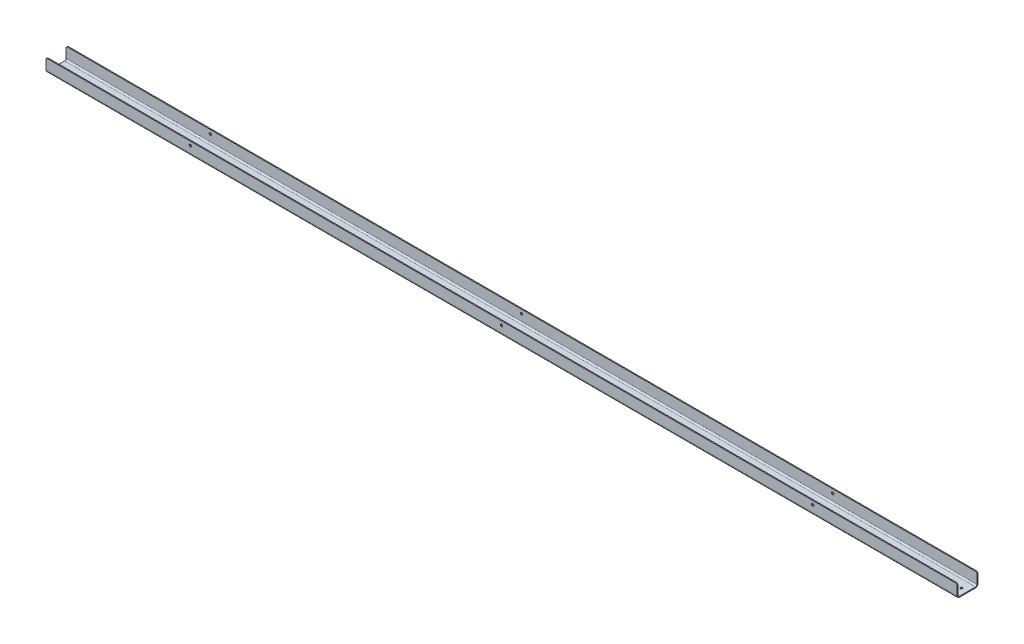
ISO-10303-21;
HEADER;
FILE_DESCRIPTION(('STEP AP214'),'2;1');
FILE_NAME('part.step','',(''),(''),'','','');
FILE_SCHEMA(('AUTOMOTIVE_DESIGN { 1 0 10303 214 1 1 1 1 }'));
ENDSEC;
DATA;
#1=APPLICATION_CONTEXT('core data for automotive mechanical design processes');
#2=APPLICATION_PROTOCOL_DEFINITION('international standard','automotive_design',2000,#1);
#3=PRODUCT_CONTEXT('',#1,'mechanical');
#4=PRODUCT('Part','Part','',(#3));
#5=PRODUCT_RELATED_PRODUCT_CATEGORY('part','',(#4));
#6=PRODUCT_DEFINITION_FORMATION('','',#4);
#7=PRODUCT_DEFINITION_CONTEXT('part definition',#1,'design');
#8=PRODUCT_DEFINITION('design','',#6,#7);
#9=PRODUCT_DEFINITION_SHAPE('','',#8);
#10=(LENGTH_UNIT() NAMED_UNIT(*) SI_UNIT(.MILLI.,.METRE.));
#11=(NAMED_UNIT(*) PLANE_ANGLE_UNIT() SI_UNIT($,.RADIAN.));
#12=(NAMED_UNIT(*) SI_UNIT($,.STERADIAN.) SOLID_ANGLE_UNIT());
#13=UNCERTAINTY_MEASURE_WITH_UNIT(LENGTH_MEASURE(1.E-05),#10,'distance_accuracy_value','');
#14=(GEOMETRIC_REPRESENTATION_CONTEXT(3) GLOBAL_UNCERTAINTY_ASSIGNED_CONTEXT((#13)) GLOBAL_UNIT_ASSIGNED_CONTEXT((#10,
#11,#12)) REPRESENTATION_CONTEXT('',''));
#15=CARTESIAN_POINT('',(0.,0.,0.));
#16=DIRECTION('',(0.,0.,1.));
#17=DIRECTION('',(1.,0.,0.));
#18=AXIS2_PLACEMENT_3D('',#15,#16,#17);
#19=CARTESIAN_POINT('',(1928.8125,5.207,0.));
#20=DIRECTION('',(1.,0.,0.));
#21=DIRECTION('',(0.,0.,-1.));
#22=AXIS2_PLACEMENT_3D('',#19,#20,#21);
#23=PLANE('',#22);
#24=DIRECTION('',(0.,0.,-1.));
#25=VECTOR('',#24,1.);
#26=CARTESIAN_POINT('',(1928.8125,5.207,0.));
#27=LINE('',#26,#25);
#28=CARTESIAN_POINT('',(1928.8125,5.207,0.));
#29=VERTEX_POINT('',#28);
#30=CARTESIAN_POINT('',(1928.8125,5.207,-2.032));
#31=VERTEX_POINT('',#30);
#32=EDGE_CURVE('E317',#29,#31,#27,.T.);
#33=ORIENTED_EDGE('',*,*,#32,.F.);
#34=CARTESIAN_POINT('',(1928.8125,5.207,-5.207));
#35=DIRECTION('',(-1.,0.,0.));
#36=DIRECTION('',(0.,0.,1.));
#37=AXIS2_PLACEMENT_3D('',#34,#35,#36);
#38=CIRCLE('',#37,5.207);
#39=CARTESIAN_POINT('',(1928.8125,0.,-5.207));
#40=VERTEX_POINT('',#39);
#41=EDGE_CURVE('E214',#29,#40,#38,.F.);
#42=ORIENTED_EDGE('',*,*,#41,.T.);
#43=DIRECTION('',(0.,-1.,0.));
#44=VECTOR('',#43,1.);
#45=CARTESIAN_POINT('',(1928.8125,2.032,-5.207));
#46=LINE('',#45,#44);
#47=CARTESIAN_POINT('',(1928.8125,2.032,-5.207));
#48=VERTEX_POINT('',#47);
#49=EDGE_CURVE('E314',#48,#40,#46,.T.);
#50=ORIENTED_EDGE('',*,*,#49,.F.);
#51=CARTESIAN_POINT('',(1928.8125,5.207,-5.207));
#52=DIRECTION('',(1.,0.,0.));
#53=DIRECTION('',(0.,0.,-1.));
#54=AXIS2_PLACEMENT_3D('',#51,#52,#53);
#55=CIRCLE('',#54,3.175);
#56=EDGE_CURVE('E201',#31,#48,#55,.T.);
#57=ORIENTED_EDGE('',*,*,#56,.F.);
#58=EDGE_LOOP('',(#33,#42,#50,#57));
#59=FACE_BOUND('',#58,.T.);
#60=ADVANCED_FACE('F45',(#59),#23,.T.);
#61=CARTESIAN_POINT('',(1928.8125,2.032,-5.207));
#62=DIRECTION('',(1.,0.,0.));
#63=DIRECTION('',(0.,0.,-1.));
#64=AXIS2_PLACEMENT_3D('',#61,#62,#63);
#65=PLANE('',#64);
#66=DIRECTION('',(0.,-1.,0.));
#67=VECTOR('',#66,1.);
#68=CARTESIAN_POINT('',(1928.8125,27.432,-2.032));
#69=LINE('',#68,#67);
#70=CARTESIAN_POINT('',(1928.8125,24.257,-2.032));
#71=VERTEX_POINT('',#70);
#72=EDGE_CURVE('E208',#71,#31,#69,.T.);
#73=ORIENTED_EDGE('',*,*,#72,.F.);
#74=DIRECTION('',(0.,0.,-1.));
#75=VECTOR('',#74,1.);
#76=CARTESIAN_POINT('',(1928.8125,24.257,-5.207));
#77=LINE('',#76,#75);
#78=CARTESIAN_POINT('',(1928.8125,24.257,0.));
#79=VERTEX_POINT('',#78);
#80=EDGE_CURVE('E334',#71,#79,#77,.F.);
#81=ORIENTED_EDGE('',*,*,#80,.T.);
#82=DIRECTION('',(0.,-1.,0.));
#83=VECTOR('',#82,1.);
#84=CARTESIAN_POINT('',(1928.8125,27.432,0.));
#85=LINE('',#84,#83);
#86=EDGE_CURVE('E211',#79,#29,#85,.T.);
#87=ORIENTED_EDGE('',*,*,#86,.T.);
#88=ORIENTED_EDGE('',*,*,#32,.T.);
#89=EDGE_LOOP('',(#73,#81,#87,#88));
#90=FACE_BOUND('',#89,.T.);
#91=ADVANCED_FACE('F405',(#90),#65,.T.);
#92=CARTESIAN_POINT('',(0.,0.,-5.207));
#93=DIRECTION('',(-1.,0.,0.));
#94=DIRECTION('',(0.,0.,1.));
#95=AXIS2_PLACEMENT_3D('',#92,#93,#94);
#96=PLANE('',#95);
#97=DIRECTION('',(0.,1.,0.));
#98=VECTOR('',#97,1.);
#99=CARTESIAN_POINT('',(0.,0.,-5.207));
#100=LINE('',#99,#98);
#101=CARTESIAN_POINT('',(0.,0.,-5.207));
#102=VERTEX_POINT('',#101);
#103=CARTESIAN_POINT('',(0.,2.032,-5.207));
#104=VERTEX_POINT('',#103);
#105=EDGE_CURVE('E311',#102,#104,#100,.T.);
#106=ORIENTED_EDGE('',*,*,#105,.F.);
#107=CARTESIAN_POINT('',(0.,5.207,-5.207));
#108=DIRECTION('',(-1.,0.,0.));
#109=DIRECTION('',(0.,0.,1.));
#110=AXIS2_PLACEMENT_3D('',#107,#108,#109);
#111=CIRCLE('',#110,5.207);
#112=CARTESIAN_POINT('',(0.,5.207,0.));
#113=VERTEX_POINT('',#112);
#114=EDGE_CURVE('E249',#113,#102,#111,.F.);
#115=ORIENTED_EDGE('',*,*,#114,.F.);
#116=DIRECTION('',(0.,0.,1.));
#117=VECTOR('',#116,1.);
#118=CARTESIAN_POINT('',(0.,5.207,-2.032));
#119=LINE('',#118,#117);
#120=CARTESIAN_POINT('',(0.,5.207,-2.032));
#121=VERTEX_POINT('',#120);
#122=EDGE_CURVE('E307',#121,#113,#119,.T.);
#123=ORIENTED_EDGE('',*,*,#122,.F.);
#124=CARTESIAN_POINT('',(0.,5.207,-5.207));
#125=DIRECTION('',(1.,0.,0.));
#126=DIRECTION('',(0.,0.,-1.));
#127=AXIS2_PLACEMENT_3D('',#124,#125,#126);
#128=CIRCLE('',#127,3.175);
#129=EDGE_CURVE('E239',#121,#104,#128,.T.);
#130=ORIENTED_EDGE('',*,*,#129,.T.);
#131=EDGE_LOOP('',(#106,#115,#123,#130));
#132=FACE_BOUND('',#131,.T.);
#133=ADVANCED_FACE('F385',(#132),#96,.T.);
#134=CARTESIAN_POINT('',(0.,5.207,-2.032));
#135=DIRECTION('',(-1.,0.,0.));
#136=DIRECTION('',(0.,0.,1.));
#137=AXIS2_PLACEMENT_3D('',#134,#135,#136);
#138=PLANE('',#137);
#139=DIRECTION('',(0.,0.,-1.));
#140=VECTOR('',#139,1.);
#141=CARTESIAN_POINT('',(0.,0.,0.));
#142=LINE('',#141,#140);
#143=CARTESIAN_POINT('',(0.,0.,-39.243));
#144=VERTEX_POINT('',#143);
#145=EDGE_CURVE('E253',#102,#144,#142,.T.);
#146=ORIENTED_EDGE('',*,*,#145,.F.);
#147=ORIENTED_EDGE('',*,*,#105,.T.);
#148=DIRECTION('',(0.,0.,-1.));
#149=VECTOR('',#148,1.);
#150=CARTESIAN_POINT('',(0.,2.032,0.));
#151=LINE('',#150,#149);
#152=CARTESIAN_POINT('',(0.,2.032,-39.243));
#153=VERTEX_POINT('',#152);
#154=EDGE_CURVE('E235',#104,#153,#151,.T.);
#155=ORIENTED_EDGE('',*,*,#154,.T.);
#156=DIRECTION('',(0.,-1.,0.));
#157=VECTOR('',#156,1.);
#158=CARTESIAN_POINT('',(0.,2.032,-39.243));
#159=LINE('',#158,#157);
#160=EDGE_CURVE('E300',#153,#144,#159,.T.);
#161=ORIENTED_EDGE('',*,*,#160,.T.);
#162=EDGE_LOOP('',(#146,#147,#155,#161));
#163=FACE_BOUND('',#162,.T.);
#164=ADVANCED_FACE('F433',(#163),#138,.T.);
#165=CARTESIAN_POINT('',(1928.8125,0.,-39.243));
#166=DIRECTION('',(1.,0.,0.));
#167=DIRECTION('',(0.,0.,-1.));
#168=AXIS2_PLACEMENT_3D('',#165,#166,#167);
#169=PLANE('',#168);
#170=DIRECTION('',(0.,1.,0.));
#171=VECTOR('',#170,1.);
#172=CARTESIAN_POINT('',(1928.8125,0.,-39.243));
#173=LINE('',#172,#171);
#174=CARTESIAN_POINT('',(1928.8125,0.,-39.243));
#175=VERTEX_POINT('',#174);
#176=CARTESIAN_POINT('',(1928.8125,2.032,-39.243));
#177=VERTEX_POINT('',#176);
#178=EDGE_CURVE('E173',#175,#177,#173,.T.);
#179=ORIENTED_EDGE('',*,*,#178,.F.);
#180=CARTESIAN_POINT('',(1928.8125,5.207,-39.243));
#181=DIRECTION('',(-1.,0.,0.));
#182=DIRECTION('',(0.,0.,1.));
#183=AXIS2_PLACEMENT_3D('',#180,#181,#182);
#184=CIRCLE('',#183,5.207);
#185=CARTESIAN_POINT('',(1928.8125,5.207,-44.45));
#186=VERTEX_POINT('',#185);
#187=EDGE_CURVE('E170',#175,#186,#184,.F.);
#188=ORIENTED_EDGE('',*,*,#187,.T.);
#189=DIRECTION('',(0.,0.,-1.));
#190=VECTOR('',#189,1.);
#191=CARTESIAN_POINT('',(1928.8125,5.207,-42.418));
#192=LINE('',#191,#190);
#193=CARTESIAN_POINT('',(1928.8125,5.207,-42.418));
#194=VERTEX_POINT('',#193);
#195=EDGE_CURVE('E163',#194,#186,#192,.T.);
#196=ORIENTED_EDGE('',*,*,#195,.F.);
#197=CARTESIAN_POINT('',(1928.8125,5.207,-39.243));
#198=DIRECTION('',(1.,0.,0.));
#199=DIRECTION('',(0.,0.,-1.));
#200=AXIS2_PLACEMENT_3D('',#197,#198,#199);
#201=CIRCLE('',#200,3.175);
#202=EDGE_CURVE('E167',#177,#194,#201,.T.);
#203=ORIENTED_EDGE('',*,*,#202,.F.);
#204=EDGE_LOOP('',(#179,#188,#196,#203));
#205=FACE_BOUND('',#204,.T.);
#206=ADVANCED_FACE('F165',(#205),#169,.T.);
#207=CARTESIAN_POINT('',(1928.8125,5.207,-42.418));
#208=DIRECTION('',(1.,0.,0.));
#209=DIRECTION('',(0.,0.,-1.));
#210=AXIS2_PLACEMENT_3D('',#207,#208,#209);
#211=PLANE('',#210);
#212=DIRECTION('',(0.,0.,-1.));
#213=VECTOR('',#212,1.);
#214=CARTESIAN_POINT('',(1928.8125,0.,0.));
#215=LINE('',#214,#213);
#216=EDGE_CURVE('E218',#40,#175,#215,.T.);
#217=ORIENTED_EDGE('',*,*,#216,.T.);
#218=ORIENTED_EDGE('',*,*,#178,.T.);
#219=DIRECTION('',(0.,0.,-1.));
#220=VECTOR('',#219,1.);
#221=CARTESIAN_POINT('',(1928.8125,2.032,0.));
#222=LINE('',#221,#220);
#223=EDGE_CURVE('E197',#48,#177,#222,.T.);
#224=ORIENTED_EDGE('',*,*,#223,.F.);
#225=ORIENTED_EDGE('',*,*,#49,.T.);
#226=EDGE_LOOP('',(#217,#218,#224,#225));
#227=FACE_BOUND('',#226,.T.);
#228=ADVANCED_FACE('F439',(#227),#211,.T.);
#229=CARTESIAN_POINT('',(0.,5.207,-44.45));
#230=DIRECTION('',(-1.,0.,0.));
#231=DIRECTION('',(0.,0.,1.));
#232=AXIS2_PLACEMENT_3D('',#229,#230,#231);
#233=PLANE('',#232);
#234=DIRECTION('',(0.,0.,1.));
#235=VECTOR('',#234,1.);
#236=CARTESIAN_POINT('',(0.,5.207,-44.45));
#237=LINE('',#236,#235);
#238=CARTESIAN_POINT('',(0.,5.207,-44.45));
#239=VERTEX_POINT('',#238);
#240=CARTESIAN_POINT('',(0.,5.207,-42.418));
#241=VERTEX_POINT('',#240);
#242=EDGE_CURVE('E174',#239,#241,#237,.T.);
#243=ORIENTED_EDGE('',*,*,#242,.F.);
#244=CARTESIAN_POINT('',(0.,5.207,-39.243));
#245=DIRECTION('',(-1.,0.,0.));
#246=DIRECTION('',(0.,0.,1.));
#247=AXIS2_PLACEMENT_3D('',#244,#245,#246);
#248=CIRCLE('',#247,5.207);
#249=EDGE_CURVE('E257',#144,#239,#248,.F.);
#250=ORIENTED_EDGE('',*,*,#249,.F.);
#251=ORIENTED_EDGE('',*,*,#160,.F.);
#252=CARTESIAN_POINT('',(0.,5.207,-39.243));
#253=DIRECTION('',(1.,0.,0.));
#254=DIRECTION('',(0.,0.,-1.));
#255=AXIS2_PLACEMENT_3D('',#252,#253,#254);
#256=CIRCLE('',#255,3.175);
#257=EDGE_CURVE('E232',#153,#241,#256,.T.);
#258=ORIENTED_EDGE('',*,*,#257,.T.);
#259=EDGE_LOOP('',(#243,#250,#251,#258));
#260=FACE_BOUND('',#259,.T.);
#261=ADVANCED_FACE('F442',(#260),#233,.T.);
#262=CARTESIAN_POINT('',(0.,2.032,-39.243));
#263=DIRECTION('',(-1.,0.,0.));
#264=DIRECTION('',(0.,0.,1.));
#265=AXIS2_PLACEMENT_3D('',#262,#263,#264);
#266=PLANE('',#265);
#267=DIRECTION('',(0.,1.,0.));
#268=VECTOR('',#267,1.);
#269=CARTESIAN_POINT('',(0.,0.,-42.418));
#270=LINE('',#269,#268);
#271=CARTESIAN_POINT('',(0.,24.257,-42.418));
#272=VERTEX_POINT('',#271);
#273=EDGE_CURVE('E181',#241,#272,#270,.T.);
#274=ORIENTED_EDGE('',*,*,#273,.T.);
#275=DIRECTION('',(0.,0.,-1.));
#276=VECTOR('',#275,1.);
#277=CARTESIAN_POINT('',(0.,24.257,-39.243));
#278=LINE('',#277,#276);
#279=CARTESIAN_POINT('',(0.,24.257,-44.45));
#280=VERTEX_POINT('',#279);
#281=EDGE_CURVE('E11',#272,#280,#278,.T.);
#282=ORIENTED_EDGE('',*,*,#281,.T.);
#283=DIRECTION('',(0.,1.,0.));
#284=VECTOR('',#283,1.);
#285=CARTESIAN_POINT('',(0.,0.,-44.45));
#286=LINE('',#285,#284);
#287=EDGE_CURVE('E225',#239,#280,#286,.T.);
#288=ORIENTED_EDGE('',*,*,#287,.F.);
#289=ORIENTED_EDGE('',*,*,#242,.T.);
#290=EDGE_LOOP('',(#274,#282,#288,#289));
#291=FACE_BOUND('',#290,.T.);
#292=ADVANCED_FACE('F446',(#291),#266,.T.);
#293=CARTESIAN_POINT('',(1928.8125,0.,-44.45));
#294=DIRECTION('',(0.,0.,1.));
#295=DIRECTION('',(1.,0.,0.));
#296=AXIS2_PLACEMENT_3D('',#293,#294,#295);
#297=PLANE('',#296);
#298=CARTESIAN_POINT('',(1623.21875,19.05,-44.45));
#299=DIRECTION('',(0.,0.,-1.));
#300=DIRECTION('',(-1.,0.,0.));
#301=AXIS2_PLACEMENT_3D('',#298,#299,#300);
#302=CIRCLE('',#301,2.45110000000003);
#303=CARTESIAN_POINT('',(1620.76765,19.05,-44.45));
#304=VERTEX_POINT('',#303);
#305=EDGE_CURVE('E546',#304,#304,#302,.T.);
#306=ORIENTED_EDGE('',*,*,#305,.F.);
#307=EDGE_LOOP('',(#306));
#308=FACE_BOUND('',#307,.T.);
#309=CARTESIAN_POINT('',(964.40625,19.05,-44.45));
#310=DIRECTION('',(0.,0.,-1.));
#311=DIRECTION('',(-1.,0.,0.));
#312=AXIS2_PLACEMENT_3D('',#309,#310,#311);
#313=CIRCLE('',#312,2.45110000000003);
#314=CARTESIAN_POINT('',(961.95515,19.05,-44.45));
#315=VERTEX_POINT('',#314);
#316=EDGE_CURVE('E561',#315,#315,#313,.T.);
#317=ORIENTED_EDGE('',*,*,#316,.F.);
#318=EDGE_LOOP('',(#317));
#319=FACE_BOUND('',#318,.T.);
#320=CARTESIAN_POINT('',(305.59375,19.05,-44.45));
#321=DIRECTION('',(0.,0.,-1.));
#322=DIRECTION('',(-1.,0.,0.));
#323=AXIS2_PLACEMENT_3D('',#320,#321,#322);
#324=CIRCLE('',#323,2.45109999999997);
#325=CARTESIAN_POINT('',(303.14265,19.05,-44.45));
#326=VERTEX_POINT('',#325);
#327=EDGE_CURVE('E569',#326,#326,#324,.T.);
#328=ORIENTED_EDGE('',*,*,#327,.F.);
#329=EDGE_LOOP('',(#328));
#330=FACE_BOUND('',#329,.T.);
#331=DIRECTION('',(-1.,0.,0.));
#332=VECTOR('',#331,1.);
#333=CARTESIAN_POINT('',(1928.8125,27.432,-44.45));
#334=LINE('',#333,#332);
#335=CARTESIAN_POINT('',(1925.6375,27.432,-44.45));
#336=VERTEX_POINT('',#335);
#337=CARTESIAN_POINT('',(3.17499999999993,27.432,-44.45));
#338=VERTEX_POINT('',#337);
#339=EDGE_CURVE('E296',#336,#338,#334,.T.);
#340=ORIENTED_EDGE('',*,*,#339,.F.);
#341=CARTESIAN_POINT('',(1925.6375,24.257,-44.45));
#342=DIRECTION('',(0.,0.,1.));
#343=DIRECTION('',(1.,0.,0.));
#344=AXIS2_PLACEMENT_3D('',#341,#342,#343);
#345=CIRCLE('',#344,3.175);
#346=CARTESIAN_POINT('',(1928.8125,24.257,-44.45));
#347=VERTEX_POINT('',#346);
#348=EDGE_CURVE('E353',#336,#347,#345,.F.);
#349=ORIENTED_EDGE('',*,*,#348,.T.);
#350=DIRECTION('',(0.,1.,0.));
#351=VECTOR('',#350,1.);
#352=CARTESIAN_POINT('',(1928.8125,0.,-44.45));
#353=LINE('',#352,#351);
#354=EDGE_CURVE('E191',#186,#347,#353,.T.);
#355=ORIENTED_EDGE('',*,*,#354,.F.);
#356=DIRECTION('',(-1.,0.,0.));
#357=VECTOR('',#356,1.);
#358=CARTESIAN_POINT('',(1928.8125,5.207,-44.45));
#359=LINE('',#358,#357);
#360=EDGE_CURVE('E224',#186,#239,#359,.T.);
#361=ORIENTED_EDGE('',*,*,#360,.T.);
#362=ORIENTED_EDGE('',*,*,#287,.T.);
#363=CARTESIAN_POINT('',(3.175,24.257,-44.45));
#364=DIRECTION('',(0.,0.,1.));
#365=DIRECTION('',(1.,0.,0.));
#366=AXIS2_PLACEMENT_3D('',#363,#364,#365);
#367=CIRCLE('',#366,3.175);
#368=EDGE_CURVE('E350',#280,#338,#367,.F.);
#369=ORIENTED_EDGE('',*,*,#368,.T.);
#370=EDGE_LOOP('',(#340,#349,#355,#361,#362,#369));
#371=FACE_BOUND('',#370,.T.);
#372=ADVANCED_FACE('F450',(#308,#319,#330,#371),#297,.F.);
#373=CARTESIAN_POINT('',(1928.8125,27.432,-42.418));
#374=DIRECTION('',(0.,1.,0.));
#375=DIRECTION('',(0.,0.,1.));
#376=AXIS2_PLACEMENT_3D('',#373,#374,#375);
#377=PLANE('',#376);
#378=DIRECTION('',(-1.,0.,0.));
#379=VECTOR('',#378,1.);
#380=CARTESIAN_POINT('',(1928.8125,27.432,-42.418));
#381=LINE('',#380,#379);
#382=CARTESIAN_POINT('',(1925.6375,27.432,-42.418));
#383=VERTEX_POINT('',#382);
#384=CARTESIAN_POINT('',(3.17499999999993,27.432,-42.418));
#385=VERTEX_POINT('',#384);
#386=EDGE_CURVE('E186',#383,#385,#381,.T.);
#387=ORIENTED_EDGE('',*,*,#386,.F.);
#388=DIRECTION('',(0.,0.,-1.));
#389=VECTOR('',#388,1.);
#390=CARTESIAN_POINT('',(1925.6375,27.432,-42.418));
#391=LINE('',#390,#389);
#392=EDGE_CURVE('E346',#383,#336,#391,.T.);
#393=ORIENTED_EDGE('',*,*,#392,.T.);
#394=ORIENTED_EDGE('',*,*,#339,.T.);
#395=DIRECTION('',(0.,0.,-1.));
#396=VECTOR('',#395,1.);
#397=CARTESIAN_POINT('',(3.17499999999993,27.432,-42.418));
#398=LINE('',#397,#396);
#399=EDGE_CURVE('E343',#338,#385,#398,.F.);
#400=ORIENTED_EDGE('',*,*,#399,.T.);
#401=EDGE_LOOP('',(#387,#393,#394,#400));
#402=FACE_BOUND('',#401,.T.);
#403=ADVANCED_FACE('F454',(#402),#377,.T.);
#404=CARTESIAN_POINT('',(1928.8125,0.,-42.418));
#405=DIRECTION('',(0.,0.,1.));
#406=DIRECTION('',(1.,0.,0.));
#407=AXIS2_PLACEMENT_3D('',#404,#405,#406);
#408=PLANE('',#407);
#409=CARTESIAN_POINT('',(1623.21875,19.05,-42.418));
#410=DIRECTION('',(0.,0.,1.));
#411=DIRECTION('',(1.,0.,0.));
#412=AXIS2_PLACEMENT_3D('',#409,#410,#411);
#413=CIRCLE('',#412,2.45110000000003);
#414=CARTESIAN_POINT('',(1625.66985,19.05,-42.418));
#415=VERTEX_POINT('',#414);
#416=EDGE_CURVE('E586',#415,#415,#413,.T.);
#417=ORIENTED_EDGE('',*,*,#416,.F.);
#418=EDGE_LOOP('',(#417));
#419=FACE_BOUND('',#418,.T.);
#420=CARTESIAN_POINT('',(964.40625,19.05,-42.418));
#421=DIRECTION('',(0.,0.,1.));
#422=DIRECTION('',(1.,0.,0.));
#423=AXIS2_PLACEMENT_3D('',#420,#421,#422);
#424=CIRCLE('',#423,2.45110000000003);
#425=CARTESIAN_POINT('',(966.85735,19.05,-42.418));
#426=VERTEX_POINT('',#425);
#427=EDGE_CURVE('E580',#426,#426,#424,.T.);
#428=ORIENTED_EDGE('',*,*,#427,.F.);
#429=EDGE_LOOP('',(#428));
#430=FACE_BOUND('',#429,.T.);
#431=CARTESIAN_POINT('',(305.59375,19.05,-42.418));
#432=DIRECTION('',(0.,0.,1.));
#433=DIRECTION('',(1.,0.,0.));
#434=AXIS2_PLACEMENT_3D('',#431,#432,#433);
#435=CIRCLE('',#434,2.45109999999997);
#436=CARTESIAN_POINT('',(308.04485,19.05,-42.418));
#437=VERTEX_POINT('',#436);
#438=EDGE_CURVE('E552',#437,#437,#435,.T.);
#439=ORIENTED_EDGE('',*,*,#438,.F.);
#440=EDGE_LOOP('',(#439));
#441=FACE_BOUND('',#440,.T.);
#442=DIRECTION('',(0.,1.,0.));
#443=VECTOR('',#442,1.);
#444=CARTESIAN_POINT('',(1928.8125,0.,-42.418));
#445=LINE('',#444,#443);
#446=CARTESIAN_POINT('',(1928.8125,24.257,-42.418));
#447=VERTEX_POINT('',#446);
#448=EDGE_CURVE('E179',#194,#447,#445,.T.);
#449=ORIENTED_EDGE('',*,*,#448,.T.);
#450=CARTESIAN_POINT('',(1925.6375,24.257,-42.418));
#451=DIRECTION('',(0.,0.,1.));
#452=DIRECTION('',(1.,0.,0.));
#453=AXIS2_PLACEMENT_3D('',#450,#451,#452);
#454=CIRCLE('',#453,3.175);
#455=EDGE_CURVE('E360',#447,#383,#454,.T.);
#456=ORIENTED_EDGE('',*,*,#455,.T.);
#457=ORIENTED_EDGE('',*,*,#386,.T.);
#458=CARTESIAN_POINT('',(3.175,24.257,-42.418));
#459=DIRECTION('',(0.,0.,1.));
#460=DIRECTION('',(1.,0.,0.));
#461=AXIS2_PLACEMENT_3D('',#458,#459,#460);
#462=CIRCLE('',#461,3.175);
#463=EDGE_CURVE('E61',#385,#272,#462,.T.);
#464=ORIENTED_EDGE('',*,*,#463,.T.);
#465=ORIENTED_EDGE('',*,*,#273,.F.);
#466=DIRECTION('',(-1.,0.,0.));
#467=VECTOR('',#466,1.);
#468=CARTESIAN_POINT('',(1928.8125,5.207,-42.418));
#469=LINE('',#468,#467);
#470=EDGE_CURVE('E177',#194,#241,#469,.T.);
#471=ORIENTED_EDGE('',*,*,#470,.F.);
#472=EDGE_LOOP('',(#449,#456,#457,#464,#465,#471));
#473=FACE_BOUND('',#472,.T.);
#474=ADVANCED_FACE('F178',(#419,#430,#441,#473),#408,.T.);
#475=CARTESIAN_POINT('',(1928.8125,5.207,-39.243));
#476=DIRECTION('',(-1.,0.,0.));
#477=DIRECTION('',(0.,0.,1.));
#478=AXIS2_PLACEMENT_3D('',#475,#476,#477);
#479=CYLINDRICAL_SURFACE('',#478,3.175);
#480=ORIENTED_EDGE('',*,*,#257,.F.);
#481=DIRECTION('',(-1.,0.,0.));
#482=VECTOR('',#481,1.);
#483=CARTESIAN_POINT('',(1928.8125,2.032,-39.243));
#484=LINE('',#483,#482);
#485=EDGE_CURVE('E187',#177,#153,#484,.T.);
#486=ORIENTED_EDGE('',*,*,#485,.F.);
#487=ORIENTED_EDGE('',*,*,#202,.T.);
#488=ORIENTED_EDGE('',*,*,#470,.T.);
#489=EDGE_LOOP('',(#480,#486,#487,#488));
#490=FACE_BOUND('',#489,.T.);
#491=ADVANCED_FACE('F194',(#490),#479,.F.);
#492=CARTESIAN_POINT('',(1928.8125,2.032,0.));
#493=DIRECTION('',(0.,1.,0.));
#494=DIRECTION('',(0.,0.,1.));
#495=AXIS2_PLACEMENT_3D('',#492,#493,#494);
#496=PLANE('',#495);
#497=CARTESIAN_POINT('',(12.7,2.032,-22.2250000000001));
#498=DIRECTION('',(0.,1.,0.));
#499=DIRECTION('',(0.,0.,1.));
#500=AXIS2_PLACEMENT_3D('',#497,#498,#499);
#501=CIRCLE('',#500,2.4511);
#502=CARTESIAN_POINT('',(12.7,2.032,-19.7739000000001));
#503=VERTEX_POINT('',#502);
#504=EDGE_CURVE('E229',#503,#503,#501,.T.);
#505=ORIENTED_EDGE('',*,*,#504,.F.);
#506=EDGE_LOOP('',(#505));
#507=FACE_BOUND('',#506,.T.);
#508=CARTESIAN_POINT('',(1258.85575,2.032,-22.2250000000001));
#509=DIRECTION('',(0.,1.,0.));
#510=DIRECTION('',(0.,0.,1.));
#511=AXIS2_PLACEMENT_3D('',#508,#509,#510);
#512=CIRCLE('',#511,2.45110000000003);
#513=CARTESIAN_POINT('',(1258.85575,2.032,-19.7739));
#514=VERTEX_POINT('',#513);
#515=EDGE_CURVE('E646',#514,#514,#512,.T.);
#516=ORIENTED_EDGE('',*,*,#515,.F.);
#517=EDGE_LOOP('',(#516));
#518=FACE_BOUND('',#517,.T.);
#519=CARTESIAN_POINT('',(1277.90575,2.032,-22.2250000000001));
#520=DIRECTION('',(0.,1.,0.));
#521=DIRECTION('',(0.,0.,1.));
#522=AXIS2_PLACEMENT_3D('',#519,#520,#521);
#523=CIRCLE('',#522,2.45110000000003);
#524=CARTESIAN_POINT('',(1277.90575,2.032,-19.7739));
#525=VERTEX_POINT('',#524);
#526=EDGE_CURVE('E642',#525,#525,#523,.T.);
#527=ORIENTED_EDGE('',*,*,#526,.F.);
#528=EDGE_LOOP('',(#527));
#529=FACE_BOUND('',#528,.T.);
#530=CARTESIAN_POINT('',(1897.0625,2.032,-22.2250000000001));
#531=DIRECTION('',(0.,1.,0.));
#532=DIRECTION('',(0.,0.,1.));
#533=AXIS2_PLACEMENT_3D('',#530,#531,#532);
#534=CIRCLE('',#533,2.45110000000003);
#535=CARTESIAN_POINT('',(1897.0625,2.032,-19.7739000000001));
#536=VERTEX_POINT('',#535);
#537=EDGE_CURVE('E638',#536,#536,#534,.T.);
#538=ORIENTED_EDGE('',*,*,#537,.F.);
#539=EDGE_LOOP('',(#538));
#540=FACE_BOUND('',#539,.T.);
#541=CARTESIAN_POINT('',(1916.1125,2.032,-22.2250000000001));
#542=DIRECTION('',(0.,1.,0.));
#543=DIRECTION('',(0.,0.,1.));
#544=AXIS2_PLACEMENT_3D('',#541,#542,#543);
#545=CIRCLE('',#544,2.45110000000003);
#546=CARTESIAN_POINT('',(1916.1125,2.032,-19.7739000000001));
#547=VERTEX_POINT('',#546);
#548=EDGE_CURVE('E634',#547,#547,#545,.T.);
#549=ORIENTED_EDGE('',*,*,#548,.F.);
#550=EDGE_LOOP('',(#549));
#551=FACE_BOUND('',#550,.T.);
#552=CARTESIAN_POINT('',(669.95675,2.032,-22.2250000000001));
#553=DIRECTION('',(0.,1.,0.));
#554=DIRECTION('',(0.,0.,1.));
#555=AXIS2_PLACEMENT_3D('',#552,#553,#554);
#556=CIRCLE('',#555,2.45110000000003);
#557=CARTESIAN_POINT('',(669.95675,2.032,-19.7739));
#558=VERTEX_POINT('',#557);
#559=EDGE_CURVE('E630',#558,#558,#556,.T.);
#560=ORIENTED_EDGE('',*,*,#559,.F.);
#561=EDGE_LOOP('',(#560));
#562=FACE_BOUND('',#561,.T.);
#563=CARTESIAN_POINT('',(650.90675,2.032,-22.2250000000001));
#564=DIRECTION('',(0.,1.,0.));
#565=DIRECTION('',(0.,0.,1.));
#566=AXIS2_PLACEMENT_3D('',#563,#564,#565);
#567=CIRCLE('',#566,2.45110000000003);
#568=CARTESIAN_POINT('',(650.90675,2.032,-19.7739));
#569=VERTEX_POINT('',#568);
#570=EDGE_CURVE('E626',#569,#569,#567,.T.);
#571=ORIENTED_EDGE('',*,*,#570,.F.);
#572=EDGE_LOOP('',(#571));
#573=FACE_BOUND('',#572,.T.);
#574=CARTESIAN_POINT('',(31.75,2.032,-22.2250000000001));
#575=DIRECTION('',(0.,1.,0.));
#576=DIRECTION('',(0.,0.,1.));
#577=AXIS2_PLACEMENT_3D('',#574,#575,#576);
#578=CIRCLE('',#577,2.4511);
#579=CARTESIAN_POINT('',(31.75,2.032,-19.7739000000001));
#580=VERTEX_POINT('',#579);
#581=EDGE_CURVE('E595',#580,#580,#578,.T.);
#582=ORIENTED_EDGE('',*,*,#581,.F.);
#583=EDGE_LOOP('',(#582));
#584=FACE_BOUND('',#583,.T.);
#585=ORIENTED_EDGE('',*,*,#154,.F.);
#586=DIRECTION('',(-1.,0.,0.));
#587=VECTOR('',#586,1.);
#588=CARTESIAN_POINT('',(1928.8125,2.032,-5.207));
#589=LINE('',#588,#587);
#590=EDGE_CURVE('E288',#48,#104,#589,.T.);
#591=ORIENTED_EDGE('',*,*,#590,.F.);
#592=ORIENTED_EDGE('',*,*,#223,.T.);
#593=ORIENTED_EDGE('',*,*,#485,.T.);
#594=EDGE_LOOP('',(#585,#591,#592,#593));
#595=FACE_BOUND('',#594,.T.);
#596=ADVANCED_FACE('F464',(#507,#518,#529,#540,#551,#562,#573,#584,#595),#496,.T.);
#597=CARTESIAN_POINT('',(1928.8125,5.207,-5.207));
#598=DIRECTION('',(-1.,0.,0.));
#599=DIRECTION('',(0.,0.,1.));
#600=AXIS2_PLACEMENT_3D('',#597,#598,#599);
#601=CYLINDRICAL_SURFACE('',#600,3.175);
#602=ORIENTED_EDGE('',*,*,#129,.F.);
#603=DIRECTION('',(-1.,0.,0.));
#604=VECTOR('',#603,1.);
#605=CARTESIAN_POINT('',(1928.8125,5.207,-2.032));
#606=LINE('',#605,#604);
#607=EDGE_CURVE('E284',#31,#121,#606,.T.);
#608=ORIENTED_EDGE('',*,*,#607,.F.);
#609=ORIENTED_EDGE('',*,*,#56,.T.);
#610=ORIENTED_EDGE('',*,*,#590,.T.);
#611=EDGE_LOOP('',(#602,#608,#609,#610));
#612=FACE_BOUND('',#611,.T.);
#613=ADVANCED_FACE('F381',(#612),#601,.F.);
#614=CARTESIAN_POINT('',(1928.8125,27.432,-2.032));
#615=DIRECTION('',(0.,0.,-1.));
#616=DIRECTION('',(0.,1.,0.));
#617=AXIS2_PLACEMENT_3D('',#614,#615,#616);
#618=PLANE('',#617);
#619=CARTESIAN_POINT('',(1623.21875,19.05,-2.032));
#620=DIRECTION('',(0.,0.,-1.));
#621=DIRECTION('',(0.,1.,0.));
#622=AXIS2_PLACEMENT_3D('',#619,#620,#621);
#623=CIRCLE('',#622,2.45110000000003);
#624=CARTESIAN_POINT('',(1623.21875,21.5011,-2.032));
#625=VERTEX_POINT('',#624);
#626=EDGE_CURVE('E540',#625,#625,#623,.T.);
#627=ORIENTED_EDGE('',*,*,#626,.F.);
#628=EDGE_LOOP('',(#627));
#629=FACE_BOUND('',#628,.T.);
#630=CARTESIAN_POINT('',(964.40625,19.05,-2.032));
#631=DIRECTION('',(0.,0.,-1.));
#632=DIRECTION('',(0.,1.,0.));
#633=AXIS2_PLACEMENT_3D('',#630,#631,#632);
#634=CIRCLE('',#633,2.45110000000003);
#635=CARTESIAN_POINT('',(964.40625,21.5011,-2.032));
#636=VERTEX_POINT('',#635);
#637=EDGE_CURVE('E576',#636,#636,#634,.T.);
#638=ORIENTED_EDGE('',*,*,#637,.F.);
#639=EDGE_LOOP('',(#638));
#640=FACE_BOUND('',#639,.T.);
#641=CARTESIAN_POINT('',(305.59375,19.05,-2.032));
#642=DIRECTION('',(0.,0.,-1.));
#643=DIRECTION('',(0.,1.,0.));
#644=AXIS2_PLACEMENT_3D('',#641,#642,#643);
#645=CIRCLE('',#644,2.45109999999997);
#646=CARTESIAN_POINT('',(305.59375,21.5011,-2.032));
#647=VERTEX_POINT('',#646);
#648=EDGE_CURVE('E545',#647,#647,#645,.T.);
#649=ORIENTED_EDGE('',*,*,#648,.F.);
#650=EDGE_LOOP('',(#649));
#651=FACE_BOUND('',#650,.T.);
#652=DIRECTION('',(-1.,0.,0.));
#653=VECTOR('',#652,1.);
#654=CARTESIAN_POINT('',(1928.8125,27.432,-2.032));
#655=LINE('',#654,#653);
#656=CARTESIAN_POINT('',(1925.6375,27.432,-2.032));
#657=VERTEX_POINT('',#656);
#658=CARTESIAN_POINT('',(3.17499999999993,27.432,-2.032));
#659=VERTEX_POINT('',#658);
#660=EDGE_CURVE('E280',#657,#659,#655,.T.);
#661=ORIENTED_EDGE('',*,*,#660,.F.);
#662=CARTESIAN_POINT('',(1925.6375,24.257,-2.032));
#663=DIRECTION('',(0.,0.,-1.));
#664=DIRECTION('',(0.,1.,0.));
#665=AXIS2_PLACEMENT_3D('',#662,#663,#664);
#666=CIRCLE('',#665,3.175);
#667=EDGE_CURVE('E331',#657,#71,#666,.T.);
#668=ORIENTED_EDGE('',*,*,#667,.T.);
#669=ORIENTED_EDGE('',*,*,#72,.T.);
#670=ORIENTED_EDGE('',*,*,#607,.T.);
#671=DIRECTION('',(0.,-1.,0.));
#672=VECTOR('',#671,1.);
#673=CARTESIAN_POINT('',(0.,27.432,-2.032));
#674=LINE('',#673,#672);
#675=CARTESIAN_POINT('',(0.,24.257,-2.032));
#676=VERTEX_POINT('',#675);
#677=EDGE_CURVE('E243',#676,#121,#674,.T.);
#678=ORIENTED_EDGE('',*,*,#677,.F.);
#679=CARTESIAN_POINT('',(3.175,24.257,-2.032));
#680=DIRECTION('',(0.,0.,-1.));
#681=DIRECTION('',(0.,1.,0.));
#682=AXIS2_PLACEMENT_3D('',#679,#680,#681);
#683=CIRCLE('',#682,3.175);
#684=EDGE_CURVE('E328',#676,#659,#683,.T.);
#685=ORIENTED_EDGE('',*,*,#684,.T.);
#686=EDGE_LOOP('',(#661,#668,#669,#670,#678,#685));
#687=FACE_BOUND('',#686,.T.);
#688=ADVANCED_FACE('F375',(#629,#640,#651,#687),#618,.T.);
#689=CARTESIAN_POINT('',(1928.8125,27.432,0.));
#690=DIRECTION('',(0.,1.,0.));
#691=DIRECTION('',(0.,0.,1.));
#692=AXIS2_PLACEMENT_3D('',#689,#690,#691);
#693=PLANE('',#692);
#694=DIRECTION('',(-1.,0.,0.));
#695=VECTOR('',#694,1.);
#696=CARTESIAN_POINT('',(1928.8125,27.432,0.));
#697=LINE('',#696,#695);
#698=CARTESIAN_POINT('',(1925.6375,27.432,0.));
#699=VERTEX_POINT('',#698);
#700=CARTESIAN_POINT('',(3.17499999999993,27.432,0.));
#701=VERTEX_POINT('',#700);
#702=EDGE_CURVE('E276',#699,#701,#697,.T.);
#703=ORIENTED_EDGE('',*,*,#702,.F.);
#704=DIRECTION('',(0.,0.,-1.));
#705=VECTOR('',#704,1.);
#706=CARTESIAN_POINT('',(1925.6375,27.432,0.));
#707=LINE('',#706,#705);
#708=EDGE_CURVE('E324',#699,#657,#707,.T.);
#709=ORIENTED_EDGE('',*,*,#708,.T.);
#710=ORIENTED_EDGE('',*,*,#660,.T.);
#711=DIRECTION('',(0.,0.,-1.));
#712=VECTOR('',#711,1.);
#713=CARTESIAN_POINT('',(3.175,27.432,0.));
#714=LINE('',#713,#712);
#715=EDGE_CURVE('E321',#659,#701,#714,.F.);
#716=ORIENTED_EDGE('',*,*,#715,.T.);
#717=EDGE_LOOP('',(#703,#709,#710,#716));
#718=FACE_BOUND('',#717,.T.);
#719=ADVANCED_FACE('F400',(#718),#693,.T.);
#720=CARTESIAN_POINT('',(1928.8125,27.432,0.));
#721=DIRECTION('',(0.,0.,-1.));
#722=DIRECTION('',(0.,1.,0.));
#723=AXIS2_PLACEMENT_3D('',#720,#721,#722);
#724=PLANE('',#723);
#725=CARTESIAN_POINT('',(1623.21875,19.05,0.));
#726=DIRECTION('',(0.,0.,-1.));
#727=DIRECTION('',(-1.,0.,0.));
#728=AXIS2_PLACEMENT_3D('',#725,#726,#727);
#729=CIRCLE('',#728,2.45110000000003);
#730=CARTESIAN_POINT('',(1620.76765,19.05,0.));
#731=VERTEX_POINT('',#730);
#732=EDGE_CURVE('E543',#731,#731,#729,.T.);
#733=ORIENTED_EDGE('',*,*,#732,.T.);
#734=EDGE_LOOP('',(#733));
#735=FACE_BOUND('',#734,.T.);
#736=CARTESIAN_POINT('',(964.40625,19.05,0.));
#737=DIRECTION('',(0.,0.,-1.));
#738=DIRECTION('',(-1.,0.,0.));
#739=AXIS2_PLACEMENT_3D('',#736,#737,#738);
#740=CIRCLE('',#739,2.45110000000003);
#741=CARTESIAN_POINT('',(961.95515,19.05,0.));
#742=VERTEX_POINT('',#741);
#743=EDGE_CURVE('E555',#742,#742,#740,.T.);
#744=ORIENTED_EDGE('',*,*,#743,.T.);
#745=EDGE_LOOP('',(#744));
#746=FACE_BOUND('',#745,.T.);
#747=CARTESIAN_POINT('',(305.59375,19.05,0.));
#748=DIRECTION('',(0.,0.,-1.));
#749=DIRECTION('',(-1.,0.,0.));
#750=AXIS2_PLACEMENT_3D('',#747,#748,#749);
#751=CIRCLE('',#750,2.45109999999997);
#752=CARTESIAN_POINT('',(303.14265,19.05,0.));
#753=VERTEX_POINT('',#752);
#754=EDGE_CURVE('E565',#753,#753,#751,.T.);
#755=ORIENTED_EDGE('',*,*,#754,.T.);
#756=EDGE_LOOP('',(#755));
#757=FACE_BOUND('',#756,.T.);
#758=ORIENTED_EDGE('',*,*,#86,.F.);
#759=CARTESIAN_POINT('',(1925.6375,24.257,0.));
#760=DIRECTION('',(0.,0.,-1.));
#761=DIRECTION('',(0.,1.,0.));
#762=AXIS2_PLACEMENT_3D('',#759,#760,#761);
#763=CIRCLE('',#762,3.175);
#764=EDGE_CURVE('E340',#79,#699,#763,.F.);
#765=ORIENTED_EDGE('',*,*,#764,.T.);
#766=ORIENTED_EDGE('',*,*,#702,.T.);
#767=CARTESIAN_POINT('',(3.175,24.257,0.));
#768=DIRECTION('',(0.,0.,-1.));
#769=DIRECTION('',(0.,1.,0.));
#770=AXIS2_PLACEMENT_3D('',#767,#768,#769);
#771=CIRCLE('',#770,3.175);
#772=CARTESIAN_POINT('',(0.,24.257,0.));
#773=VERTEX_POINT('',#772);
#774=EDGE_CURVE('E337',#701,#773,#771,.F.);
#775=ORIENTED_EDGE('',*,*,#774,.T.);
#776=DIRECTION('',(0.,-1.,0.));
#777=VECTOR('',#776,1.);
#778=CARTESIAN_POINT('',(0.,27.432,0.));
#779=LINE('',#778,#777);
#780=EDGE_CURVE('E246',#773,#113,#779,.T.);
#781=ORIENTED_EDGE('',*,*,#780,.T.);
#782=DIRECTION('',(-1.,0.,0.));
#783=VECTOR('',#782,1.);
#784=CARTESIAN_POINT('',(1928.8125,5.207,0.));
#785=LINE('',#784,#783);
#786=EDGE_CURVE('E272',#29,#113,#785,.T.);
#787=ORIENTED_EDGE('',*,*,#786,.F.);
#788=EDGE_LOOP('',(#758,#765,#766,#775,#781,#787));
#789=FACE_BOUND('',#788,.T.);
#790=ADVANCED_FACE('F394',(#735,#746,#757,#789),#724,.F.);
#791=CARTESIAN_POINT('',(1928.8125,5.207,-5.207));
#792=DIRECTION('',(-1.,0.,0.));
#793=DIRECTION('',(0.,0.,1.));
#794=AXIS2_PLACEMENT_3D('',#791,#792,#793);
#795=CYLINDRICAL_SURFACE('',#794,5.207);
#796=ORIENTED_EDGE('',*,*,#114,.T.);
#797=DIRECTION('',(-1.,0.,0.));
#798=VECTOR('',#797,1.);
#799=CARTESIAN_POINT('',(1928.8125,0.,-5.207));
#800=LINE('',#799,#798);
#801=EDGE_CURVE('E268',#40,#102,#800,.T.);
#802=ORIENTED_EDGE('',*,*,#801,.F.);
#803=ORIENTED_EDGE('',*,*,#41,.F.);
#804=ORIENTED_EDGE('',*,*,#786,.T.);
#805=EDGE_LOOP('',(#796,#802,#803,#804));
#806=FACE_BOUND('',#805,.T.);
#807=ADVANCED_FACE('F390',(#806),#795,.T.);
#808=CARTESIAN_POINT('',(1928.8125,0.,0.));
#809=DIRECTION('',(0.,1.,0.));
#810=DIRECTION('',(0.,0.,1.));
#811=AXIS2_PLACEMENT_3D('',#808,#809,#810);
#812=PLANE('',#811);
#813=CARTESIAN_POINT('',(12.7,0.,-22.2250000000001));
#814=DIRECTION('',(0.,-1.,0.));
#815=DIRECTION('',(0.,0.,-1.));
#816=AXIS2_PLACEMENT_3D('',#813,#814,#815);
#817=CIRCLE('',#816,2.4511);
#818=CARTESIAN_POINT('',(12.7,0.,-24.6761000000001));
#819=VERTEX_POINT('',#818);
#820=EDGE_CURVE('E591',#819,#819,#817,.T.);
#821=ORIENTED_EDGE('',*,*,#820,.F.);
#822=EDGE_LOOP('',(#821));
#823=FACE_BOUND('',#822,.T.);
#824=CARTESIAN_POINT('',(1258.85575,0.,-22.2250000000001));
#825=DIRECTION('',(0.,-1.,0.));
#826=DIRECTION('',(0.,0.,1.));
#827=AXIS2_PLACEMENT_3D('',#824,#825,#826);
#828=CIRCLE('',#827,2.45110000000003);
#829=CARTESIAN_POINT('',(1258.85575,0.,-19.7739));
#830=VERTEX_POINT('',#829);
#831=EDGE_CURVE('E590',#830,#830,#828,.T.);
#832=ORIENTED_EDGE('',*,*,#831,.F.);
#833=EDGE_LOOP('',(#832));
#834=FACE_BOUND('',#833,.T.);
#835=CARTESIAN_POINT('',(1277.90575,0.,-22.2250000000001));
#836=DIRECTION('',(0.,-1.,0.));
#837=DIRECTION('',(0.,0.,1.));
#838=AXIS2_PLACEMENT_3D('',#835,#836,#837);
#839=CIRCLE('',#838,2.45110000000003);
#840=CARTESIAN_POINT('',(1277.90575,0.,-19.7739));
#841=VERTEX_POINT('',#840);
#842=EDGE_CURVE('E602',#841,#841,#839,.T.);
#843=ORIENTED_EDGE('',*,*,#842,.F.);
#844=EDGE_LOOP('',(#843));
#845=FACE_BOUND('',#844,.T.);
#846=CARTESIAN_POINT('',(1897.0625,0.,-22.2250000000001));
#847=DIRECTION('',(0.,-1.,0.));
#848=DIRECTION('',(0.,0.,1.));
#849=AXIS2_PLACEMENT_3D('',#846,#847,#848);
#850=CIRCLE('',#849,2.45110000000003);
#851=CARTESIAN_POINT('',(1897.0625,0.,-19.7739000000001));
#852=VERTEX_POINT('',#851);
#853=EDGE_CURVE('E597',#852,#852,#850,.T.);
#854=ORIENTED_EDGE('',*,*,#853,.F.);
#855=EDGE_LOOP('',(#854));
#856=FACE_BOUND('',#855,.T.);
#857=CARTESIAN_POINT('',(1916.1125,0.,-22.2250000000001));
#858=DIRECTION('',(0.,-1.,0.));
#859=DIRECTION('',(0.,0.,1.));
#860=AXIS2_PLACEMENT_3D('',#857,#858,#859);
#861=CIRCLE('',#860,2.45110000000003);
#862=CARTESIAN_POINT('',(1916.1125,0.,-19.7739000000001));
#863=VERTEX_POINT('',#862);
#864=EDGE_CURVE('E601',#863,#863,#861,.T.);
#865=ORIENTED_EDGE('',*,*,#864,.F.);
#866=EDGE_LOOP('',(#865));
#867=FACE_BOUND('',#866,.T.);
#868=CARTESIAN_POINT('',(669.95675,0.,-22.2250000000001));
#869=DIRECTION('',(0.,-1.,0.));
#870=DIRECTION('',(0.,0.,-1.));
#871=AXIS2_PLACEMENT_3D('',#868,#869,#870);
#872=CIRCLE('',#871,2.45110000000003);
#873=CARTESIAN_POINT('',(669.95675,0.,-24.6761000000001));
#874=VERTEX_POINT('',#873);
#875=EDGE_CURVE('E616',#874,#874,#872,.T.);
#876=ORIENTED_EDGE('',*,*,#875,.F.);
#877=EDGE_LOOP('',(#876));
#878=FACE_BOUND('',#877,.T.);
#879=CARTESIAN_POINT('',(650.90675,0.,-22.2250000000001));
#880=DIRECTION('',(0.,-1.,0.));
#881=DIRECTION('',(0.,0.,-1.));
#882=AXIS2_PLACEMENT_3D('',#879,#880,#881);
#883=CIRCLE('',#882,2.45110000000003);
#884=CARTESIAN_POINT('',(650.90675,0.,-24.6761000000001));
#885=VERTEX_POINT('',#884);
#886=EDGE_CURVE('E612',#885,#885,#883,.T.);
#887=ORIENTED_EDGE('',*,*,#886,.F.);
#888=EDGE_LOOP('',(#887));
#889=FACE_BOUND('',#888,.T.);
#890=CARTESIAN_POINT('',(31.75,0.,-22.2250000000001));
#891=DIRECTION('',(0.,-1.,0.));
#892=DIRECTION('',(0.,0.,-1.));
#893=AXIS2_PLACEMENT_3D('',#890,#891,#892);
#894=CIRCLE('',#893,2.4511);
#895=CARTESIAN_POINT('',(31.75,0.,-24.6761000000001));
#896=VERTEX_POINT('',#895);
#897=EDGE_CURVE('E596',#896,#896,#894,.T.);
#898=ORIENTED_EDGE('',*,*,#897,.F.);
#899=EDGE_LOOP('',(#898));
#900=FACE_BOUND('',#899,.T.);
#901=ORIENTED_EDGE('',*,*,#145,.T.);
#902=DIRECTION('',(-1.,0.,0.));
#903=VECTOR('',#902,1.);
#904=CARTESIAN_POINT('',(1928.8125,0.,-39.243));
#905=LINE('',#904,#903);
#906=EDGE_CURVE('E264',#175,#144,#905,.T.);
#907=ORIENTED_EDGE('',*,*,#906,.F.);
#908=ORIENTED_EDGE('',*,*,#216,.F.);
#909=ORIENTED_EDGE('',*,*,#801,.T.);
#910=EDGE_LOOP('',(#901,#907,#908,#909));
#911=FACE_BOUND('',#910,.T.);
#912=ADVANCED_FACE('F480',(#823,#834,#845,#856,#867,#878,#889,#900,#911),#812,.F.);
#913=CARTESIAN_POINT('',(1928.8125,5.207,-39.243));
#914=DIRECTION('',(-1.,0.,0.));
#915=DIRECTION('',(0.,0.,1.));
#916=AXIS2_PLACEMENT_3D('',#913,#914,#915);
#917=CYLINDRICAL_SURFACE('',#916,5.207);
#918=ORIENTED_EDGE('',*,*,#249,.T.);
#919=ORIENTED_EDGE('',*,*,#360,.F.);
#920=ORIENTED_EDGE('',*,*,#187,.F.);
#921=ORIENTED_EDGE('',*,*,#906,.T.);
#922=EDGE_LOOP('',(#918,#919,#920,#921));
#923=FACE_BOUND('',#922,.T.);
#924=ADVANCED_FACE('F483',(#923),#917,.T.);
#925=CARTESIAN_POINT('',(1928.8125,5.207,-39.243));
#926=DIRECTION('',(1.,0.,0.));
#927=DIRECTION('',(0.,0.,-1.));
#928=AXIS2_PLACEMENT_3D('',#925,#926,#927);
#929=PLANE('',#928);
#930=ORIENTED_EDGE('',*,*,#354,.T.);
#931=DIRECTION('',(0.,0.,-1.));
#932=VECTOR('',#931,1.);
#933=CARTESIAN_POINT('',(1928.8125,24.257,-39.243));
#934=LINE('',#933,#932);
#935=EDGE_CURVE('E69',#347,#447,#934,.F.);
#936=ORIENTED_EDGE('',*,*,#935,.T.);
#937=ORIENTED_EDGE('',*,*,#448,.F.);
#938=ORIENTED_EDGE('',*,*,#195,.T.);
#939=EDGE_LOOP('',(#930,#936,#937,#938));
#940=FACE_BOUND('',#939,.T.);
#941=ADVANCED_FACE('F189',(#940),#929,.T.);
#942=CARTESIAN_POINT('',(0.,5.207,-39.243));
#943=DIRECTION('',(1.,0.,0.));
#944=DIRECTION('',(0.,0.,-1.));
#945=AXIS2_PLACEMENT_3D('',#942,#943,#944);
#946=PLANE('',#945);
#947=ORIENTED_EDGE('',*,*,#780,.F.);
#948=DIRECTION('',(0.,0.,-1.));
#949=VECTOR('',#948,1.);
#950=CARTESIAN_POINT('',(0.,24.257,-2.032));
#951=LINE('',#950,#949);
#952=EDGE_CURVE('E54',#773,#676,#951,.T.);
#953=ORIENTED_EDGE('',*,*,#952,.T.);
#954=ORIENTED_EDGE('',*,*,#677,.T.);
#955=ORIENTED_EDGE('',*,*,#122,.T.);
#956=EDGE_LOOP('',(#947,#953,#954,#955));
#957=FACE_BOUND('',#956,.T.);
#958=ADVANCED_FACE('F369',(#957),#946,.F.);
#959=CARTESIAN_POINT('',(31.75,27.432,-22.2250000000001));
#960=DIRECTION('',(0.,-1.,0.));
#961=DIRECTION('',(0.,0.,-1.));
#962=AXIS2_PLACEMENT_3D('',#959,#960,#961);
#963=CYLINDRICAL_SURFACE('',#962,2.4511);
#964=ORIENTED_EDGE('',*,*,#581,.T.);
#965=EDGE_LOOP('',(#964));
#966=FACE_BOUND('',#965,.T.);
#967=ORIENTED_EDGE('',*,*,#897,.T.);
#968=EDGE_LOOP('',(#967));
#969=FACE_BOUND('',#968,.T.);
#970=ADVANCED_FACE('F490',(#966,#969),#963,.F.);
#971=CARTESIAN_POINT('',(650.90675,27.432,-22.2250000000001));
#972=DIRECTION('',(0.,-1.,0.));
#973=DIRECTION('',(0.,0.,-1.));
#974=AXIS2_PLACEMENT_3D('',#971,#972,#973);
#975=CYLINDRICAL_SURFACE('',#974,2.45110000000003);
#976=ORIENTED_EDGE('',*,*,#570,.T.);
#977=EDGE_LOOP('',(#976));
#978=FACE_BOUND('',#977,.T.);
#979=ORIENTED_EDGE('',*,*,#886,.T.);
#980=EDGE_LOOP('',(#979));
#981=FACE_BOUND('',#980,.T.);
#982=ADVANCED_FACE('F501',(#978,#981),#975,.F.);
#983=CARTESIAN_POINT('',(669.95675,27.432,-22.2250000000001));
#984=DIRECTION('',(0.,-1.,0.));
#985=DIRECTION('',(0.,0.,-1.));
#986=AXIS2_PLACEMENT_3D('',#983,#984,#985);
#987=CYLINDRICAL_SURFACE('',#986,2.45110000000003);
#988=ORIENTED_EDGE('',*,*,#559,.T.);
#989=EDGE_LOOP('',(#988));
#990=FACE_BOUND('',#989,.T.);
#991=ORIENTED_EDGE('',*,*,#875,.T.);
#992=EDGE_LOOP('',(#991));
#993=FACE_BOUND('',#992,.T.);
#994=ADVANCED_FACE('F497',(#990,#993),#987,.F.);
#995=CARTESIAN_POINT('',(1916.1125,27.432,-22.2250000000001));
#996=DIRECTION('',(0.,-1.,0.));
#997=DIRECTION('',(0.,0.,-1.));
#998=AXIS2_PLACEMENT_3D('',#995,#996,#997);
#999=CYLINDRICAL_SURFACE('',#998,2.45110000000003);
#1000=ORIENTED_EDGE('',*,*,#548,.T.);
#1001=EDGE_LOOP('',(#1000));
#1002=FACE_BOUND('',#1001,.T.);
#1003=ORIENTED_EDGE('',*,*,#864,.T.);
#1004=EDGE_LOOP('',(#1003));
#1005=FACE_BOUND('',#1004,.T.);
#1006=ADVANCED_FACE('F493',(#1002,#1005),#999,.F.);
#1007=CARTESIAN_POINT('',(1897.0625,27.432,-22.2250000000001));
#1008=DIRECTION('',(0.,-1.,0.));
#1009=DIRECTION('',(0.,0.,-1.));
#1010=AXIS2_PLACEMENT_3D('',#1007,#1008,#1009);
#1011=CYLINDRICAL_SURFACE('',#1010,2.45110000000003);
#1012=ORIENTED_EDGE('',*,*,#537,.T.);
#1013=EDGE_LOOP('',(#1012));
#1014=FACE_BOUND('',#1013,.T.);
#1015=ORIENTED_EDGE('',*,*,#853,.T.);
#1016=EDGE_LOOP('',(#1015));
#1017=FACE_BOUND('',#1016,.T.);
#1018=ADVANCED_FACE('F496',(#1014,#1017),#1011,.F.);
#1019=CARTESIAN_POINT('',(1277.90575,27.432,-22.2250000000001));
#1020=DIRECTION('',(0.,-1.,0.));
#1021=DIRECTION('',(0.,0.,-1.));
#1022=AXIS2_PLACEMENT_3D('',#1019,#1020,#1021);
#1023=CYLINDRICAL_SURFACE('',#1022,2.45110000000003);
#1024=ORIENTED_EDGE('',*,*,#526,.T.);
#1025=EDGE_LOOP('',(#1024));
#1026=FACE_BOUND('',#1025,.T.);
#1027=ORIENTED_EDGE('',*,*,#842,.T.);
#1028=EDGE_LOOP('',(#1027));
#1029=FACE_BOUND('',#1028,.T.);
#1030=ADVANCED_FACE('F513',(#1026,#1029),#1023,.F.);
#1031=CARTESIAN_POINT('',(1258.85575,27.432,-22.2250000000001));
#1032=DIRECTION('',(0.,-1.,0.));
#1033=DIRECTION('',(0.,0.,-1.));
#1034=AXIS2_PLACEMENT_3D('',#1031,#1032,#1033);
#1035=CYLINDRICAL_SURFACE('',#1034,2.45110000000003);
#1036=ORIENTED_EDGE('',*,*,#515,.T.);
#1037=EDGE_LOOP('',(#1036));
#1038=FACE_BOUND('',#1037,.T.);
#1039=ORIENTED_EDGE('',*,*,#831,.T.);
#1040=EDGE_LOOP('',(#1039));
#1041=FACE_BOUND('',#1040,.T.);
#1042=ADVANCED_FACE('F509',(#1038,#1041),#1035,.F.);
#1043=CARTESIAN_POINT('',(12.7,27.432,-22.2250000000001));
#1044=DIRECTION('',(0.,-1.,0.));
#1045=DIRECTION('',(0.,0.,-1.));
#1046=AXIS2_PLACEMENT_3D('',#1043,#1044,#1045);
#1047=CYLINDRICAL_SURFACE('',#1046,2.4511);
#1048=ORIENTED_EDGE('',*,*,#504,.T.);
#1049=EDGE_LOOP('',(#1048));
#1050=FACE_BOUND('',#1049,.T.);
#1051=ORIENTED_EDGE('',*,*,#820,.T.);
#1052=EDGE_LOOP('',(#1051));
#1053=FACE_BOUND('',#1052,.T.);
#1054=ADVANCED_FACE('F512',(#1050,#1053),#1047,.F.);
#1055=CARTESIAN_POINT('',(305.59375,19.05,0.));
#1056=DIRECTION('',(0.,0.,-1.));
#1057=DIRECTION('',(-1.,0.,0.));
#1058=AXIS2_PLACEMENT_3D('',#1055,#1056,#1057);
#1059=CYLINDRICAL_SURFACE('',#1058,2.45109999999997);
#1060=ORIENTED_EDGE('',*,*,#648,.T.);
#1061=EDGE_LOOP('',(#1060));
#1062=FACE_BOUND('',#1061,.T.);
#1063=ORIENTED_EDGE('',*,*,#754,.F.);
#1064=EDGE_LOOP('',(#1063));
#1065=FACE_BOUND('',#1064,.T.);
#1066=ADVANCED_FACE('F522',(#1062,#1065),#1059,.F.);
#1067=CARTESIAN_POINT('',(964.40625,19.05,0.));
#1068=DIRECTION('',(0.,0.,-1.));
#1069=DIRECTION('',(-1.,0.,0.));
#1070=AXIS2_PLACEMENT_3D('',#1067,#1068,#1069);
#1071=CYLINDRICAL_SURFACE('',#1070,2.45110000000003);
#1072=ORIENTED_EDGE('',*,*,#637,.T.);
#1073=EDGE_LOOP('',(#1072));
#1074=FACE_BOUND('',#1073,.T.);
#1075=ORIENTED_EDGE('',*,*,#743,.F.);
#1076=EDGE_LOOP('',(#1075));
#1077=FACE_BOUND('',#1076,.T.);
#1078=ADVANCED_FACE('F526',(#1074,#1077),#1071,.F.);
#1079=CARTESIAN_POINT('',(1623.21875,19.05,0.));
#1080=DIRECTION('',(0.,0.,-1.));
#1081=DIRECTION('',(-1.,0.,0.));
#1082=AXIS2_PLACEMENT_3D('',#1079,#1080,#1081);
#1083=CYLINDRICAL_SURFACE('',#1082,2.45110000000003);
#1084=ORIENTED_EDGE('',*,*,#626,.T.);
#1085=EDGE_LOOP('',(#1084));
#1086=FACE_BOUND('',#1085,.T.);
#1087=ORIENTED_EDGE('',*,*,#732,.F.);
#1088=EDGE_LOOP('',(#1087));
#1089=FACE_BOUND('',#1088,.T.);
#1090=ADVANCED_FACE('F422',(#1086,#1089),#1083,.F.);
#1091=ORIENTED_EDGE('',*,*,#438,.T.);
#1092=EDGE_LOOP('',(#1091));
#1093=FACE_BOUND('',#1092,.T.);
#1094=ORIENTED_EDGE('',*,*,#327,.T.);
#1095=EDGE_LOOP('',(#1094));
#1096=FACE_BOUND('',#1095,.T.);
#1097=ADVANCED_FACE('F528',(#1093,#1096),#1059,.F.);
#1098=ORIENTED_EDGE('',*,*,#427,.T.);
#1099=EDGE_LOOP('',(#1098));
#1100=FACE_BOUND('',#1099,.T.);
#1101=ORIENTED_EDGE('',*,*,#316,.T.);
#1102=EDGE_LOOP('',(#1101));
#1103=FACE_BOUND('',#1102,.T.);
#1104=ADVANCED_FACE('F419',(#1100,#1103),#1071,.F.);
#1105=ORIENTED_EDGE('',*,*,#416,.T.);
#1106=EDGE_LOOP('',(#1105));
#1107=FACE_BOUND('',#1106,.T.);
#1108=ORIENTED_EDGE('',*,*,#305,.T.);
#1109=EDGE_LOOP('',(#1108));
#1110=FACE_BOUND('',#1109,.T.);
#1111=ADVANCED_FACE('F410',(#1107,#1110),#1083,.F.);
#1112=CARTESIAN_POINT('',(1925.6375,24.257,0.));
#1113=DIRECTION('',(0.,0.,-1.));
#1114=DIRECTION('',(-1.,0.,0.));
#1115=AXIS2_PLACEMENT_3D('',#1112,#1113,#1114);
#1116=CYLINDRICAL_SURFACE('',#1115,3.175);
#1117=ORIENTED_EDGE('',*,*,#764,.F.);
#1118=ORIENTED_EDGE('',*,*,#80,.F.);
#1119=ORIENTED_EDGE('',*,*,#667,.F.);
#1120=ORIENTED_EDGE('',*,*,#708,.F.);
#1121=EDGE_LOOP('',(#1117,#1118,#1119,#1120));
#1122=FACE_BOUND('',#1121,.T.);
#1123=ADVANCED_FACE('F407',(#1122),#1116,.T.);
#1124=CARTESIAN_POINT('',(1925.6375,24.257,-42.418));
#1125=DIRECTION('',(0.,0.,-1.));
#1126=DIRECTION('',(-1.,0.,0.));
#1127=AXIS2_PLACEMENT_3D('',#1124,#1125,#1126);
#1128=CYLINDRICAL_SURFACE('',#1127,3.175);
#1129=ORIENTED_EDGE('',*,*,#455,.F.);
#1130=ORIENTED_EDGE('',*,*,#935,.F.);
#1131=ORIENTED_EDGE('',*,*,#348,.F.);
#1132=ORIENTED_EDGE('',*,*,#392,.F.);
#1133=EDGE_LOOP('',(#1129,#1130,#1131,#1132));
#1134=FACE_BOUND('',#1133,.T.);
#1135=ADVANCED_FACE('F409',(#1134),#1128,.T.);
#1136=CARTESIAN_POINT('',(3.175,24.257,-39.243));
#1137=DIRECTION('',(0.,0.,1.));
#1138=DIRECTION('',(1.,0.,0.));
#1139=AXIS2_PLACEMENT_3D('',#1136,#1137,#1138);
#1140=CYLINDRICAL_SURFACE('',#1139,3.175);
#1141=ORIENTED_EDGE('',*,*,#774,.F.);
#1142=ORIENTED_EDGE('',*,*,#715,.F.);
#1143=ORIENTED_EDGE('',*,*,#684,.F.);
#1144=ORIENTED_EDGE('',*,*,#952,.F.);
#1145=EDGE_LOOP('',(#1141,#1142,#1143,#1144));
#1146=FACE_BOUND('',#1145,.T.);
#1147=ADVANCED_FACE('F398',(#1146),#1140,.T.);
#1148=CARTESIAN_POINT('',(3.175,24.257,-39.243));
#1149=DIRECTION('',(0.,0.,-1.));
#1150=DIRECTION('',(-1.,0.,0.));
#1151=AXIS2_PLACEMENT_3D('',#1148,#1149,#1150);
#1152=CYLINDRICAL_SURFACE('',#1151,3.175);
#1153=ORIENTED_EDGE('',*,*,#463,.F.);
#1154=ORIENTED_EDGE('',*,*,#399,.F.);
#1155=ORIENTED_EDGE('',*,*,#368,.F.);
#1156=ORIENTED_EDGE('',*,*,#281,.F.);
#1157=EDGE_LOOP('',(#1153,#1154,#1155,#1156));
#1158=FACE_BOUND('',#1157,.T.);
#1159=ADVANCED_FACE('F47',(#1158),#1152,.T.);
#1160=CLOSED_SHELL('',(#60,#91,#133,#164,#206,#228,#261,#292,#372,#403,#474,#491,#596,#613,#688,
#719,#790,#807,#912,#924,#941,#958,#970,#982,#994,#1006,#1018,#1030,#1042,#1054,#1066,#1078,
#1090,#1097,#1104,#1111,#1123,#1135,#1147,#1159));
#1161=MANIFOLD_SOLID_BREP('B2',#1160);
#1162=ADVANCED_BREP_SHAPE_REPRESENTATION('',(#18,#1161),#14);
#1163=SHAPE_DEFINITION_REPRESENTATION(#9,#1162);
ENDSEC;
END-ISO-10303-21;
